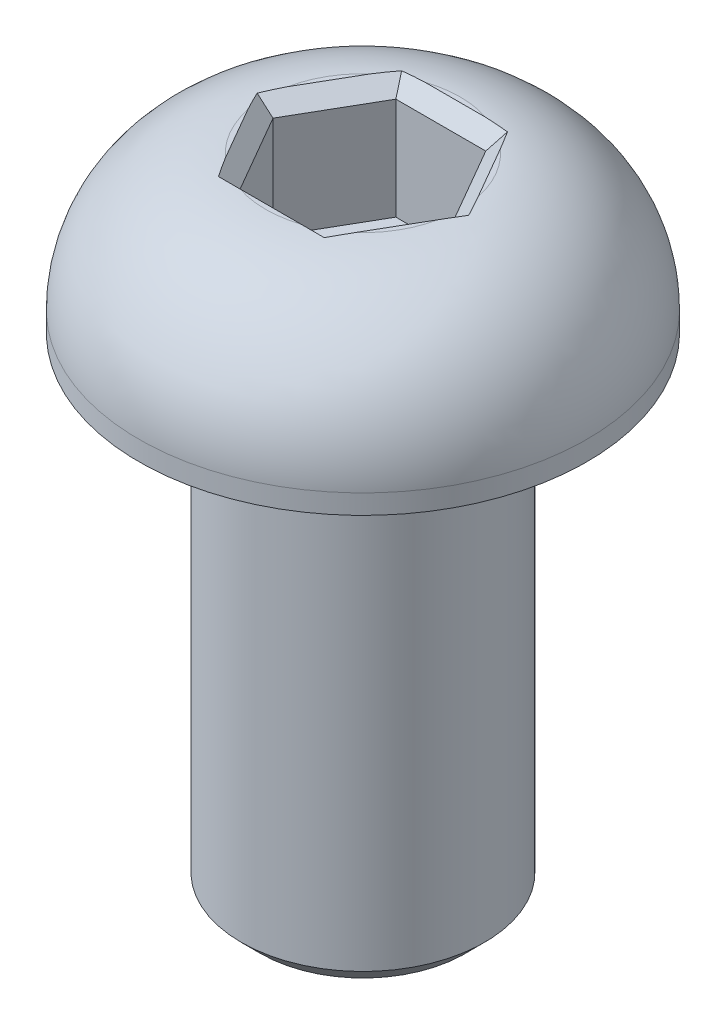
ISO-10303-21;
HEADER;
FILE_DESCRIPTION(('STEP AP214'),'2;1');
FILE_NAME('part.step','',(''),(''),'','','');
FILE_SCHEMA(('AUTOMOTIVE_DESIGN { 1 0 10303 214 1 1 1 1 }'));
ENDSEC;
DATA;
#1=APPLICATION_CONTEXT('core data for automotive mechanical design processes');
#2=APPLICATION_PROTOCOL_DEFINITION('international standard','automotive_design',2000,#1);
#3=PRODUCT_CONTEXT('',#1,'mechanical');
#4=PRODUCT('Part','Part','',(#3));
#5=PRODUCT_RELATED_PRODUCT_CATEGORY('part','',(#4));
#6=PRODUCT_DEFINITION_FORMATION('','',#4);
#7=PRODUCT_DEFINITION_CONTEXT('part definition',#1,'design');
#8=PRODUCT_DEFINITION('design','',#6,#7);
#9=PRODUCT_DEFINITION_SHAPE('','',#8);
#10=(LENGTH_UNIT() NAMED_UNIT(*) SI_UNIT(.MILLI.,.METRE.));
#11=(NAMED_UNIT(*) PLANE_ANGLE_UNIT() SI_UNIT($,.RADIAN.));
#12=(NAMED_UNIT(*) SI_UNIT($,.STERADIAN.) SOLID_ANGLE_UNIT());
#13=UNCERTAINTY_MEASURE_WITH_UNIT(LENGTH_MEASURE(1.E-05),#10,'distance_accuracy_value','');
#14=(GEOMETRIC_REPRESENTATION_CONTEXT(3) GLOBAL_UNCERTAINTY_ASSIGNED_CONTEXT((#13)) GLOBAL_UNIT_ASSIGNED_CONTEXT((#10,
#11,#12)) REPRESENTATION_CONTEXT('',''));
#15=CARTESIAN_POINT('',(0.,0.,0.));
#16=DIRECTION('',(0.,0.,1.));
#17=DIRECTION('',(1.,0.,0.));
#18=AXIS2_PLACEMENT_3D('',#15,#16,#17);
#19=CARTESIAN_POINT('',(0.,16.7549169711781,0.));
#20=DIRECTION('',(0.,-1.,0.));
#21=DIRECTION('',(0.,0.,-1.));
#22=AXIS2_PLACEMENT_3D('',#19,#20,#21);
#23=PLANE('',#22);
#24=CARTESIAN_POINT('',(0.,16.7549169711781,0.));
#25=DIRECTION('',(0.,-1.,0.));
#26=DIRECTION('',(0.,0.,-1.));
#27=AXIS2_PLACEMENT_3D('',#24,#25,#26);
#28=CIRCLE('',#27,2.54000000000019);
#29=CARTESIAN_POINT('',(2.48627667223046,16.7549169711781,0.519642482023581));
#30=VERTEX_POINT('',#29);
#31=CARTESIAN_POINT('',(1.69316192643324,16.7549169711781,1.89335751797642));
#32=VERTEX_POINT('',#31);
#33=EDGE_CURVE('E346',#30,#32,#28,.T.);
#34=ORIENTED_EDGE('',*,*,#33,.F.);
#35=DIRECTION('',(-0.500000000000001,0.,0.86602540378444));
#36=VECTOR('',#35,1.);
#37=CARTESIAN_POINT('',(2.08971929933185,16.7549169711781,1.2065));
#38=LINE('',#37,#36);
#39=EDGE_CURVE('E379',#30,#32,#38,.T.);
#40=ORIENTED_EDGE('',*,*,#39,.T.);
#41=EDGE_LOOP('',(#34,#40));
#42=FACE_BOUND('',#41,.T.);
#43=ADVANCED_FACE('F36',(#42),#23,.F.);
#44=CARTESIAN_POINT('',(0.79311474579721,16.7549169711781,2.413));
#45=VERTEX_POINT('',#44);
#46=CARTESIAN_POINT('',(-0.793114745797206,16.7549169711781,2.413));
#47=VERTEX_POINT('',#46);
#48=EDGE_CURVE('E372',#45,#47,#28,.T.);
#49=ORIENTED_EDGE('',*,*,#48,.F.);
#50=DIRECTION('',(-1.,0.,0.));
#51=VECTOR('',#50,1.);
#52=CARTESIAN_POINT('',(0.,16.7549169711781,2.413));
#53=LINE('',#52,#51);
#54=EDGE_CURVE('E377',#45,#47,#53,.T.);
#55=ORIENTED_EDGE('',*,*,#54,.T.);
#56=EDGE_LOOP('',(#49,#55));
#57=FACE_BOUND('',#56,.T.);
#58=ADVANCED_FACE('F325',(#57),#23,.F.);
#59=CARTESIAN_POINT('',(1.69316192643326,16.7549169711781,-1.89335751797642));
#60=VERTEX_POINT('',#59);
#61=CARTESIAN_POINT('',(2.48627667223046,16.7549169711781,-0.519642482023588));
#62=VERTEX_POINT('',#61);
#63=EDGE_CURVE('E209',#60,#62,#28,.T.);
#64=ORIENTED_EDGE('',*,*,#63,.F.);
#65=DIRECTION('',(0.500000000000001,0.,0.86602540378444));
#66=VECTOR('',#65,1.);
#67=CARTESIAN_POINT('',(2.08971929933186,16.7549169711781,-1.2065));
#68=LINE('',#67,#66);
#69=EDGE_CURVE('E351',#60,#62,#68,.T.);
#70=ORIENTED_EDGE('',*,*,#69,.T.);
#71=EDGE_LOOP('',(#64,#70));
#72=FACE_BOUND('',#71,.T.);
#73=ADVANCED_FACE('F330',(#72),#23,.F.);
#74=CARTESIAN_POINT('',(-1.69316192643324,16.7549169711781,1.89335751797642));
#75=VERTEX_POINT('',#74);
#76=CARTESIAN_POINT('',(-2.48627667223045,16.7549169711781,0.51964248202358));
#77=VERTEX_POINT('',#76);
#78=EDGE_CURVE('E208',#75,#77,#28,.T.);
#79=ORIENTED_EDGE('',*,*,#78,.F.);
#80=DIRECTION('',(-0.500000000000001,0.,-0.86602540378444));
#81=VECTOR('',#80,1.);
#82=CARTESIAN_POINT('',(-2.08971929933185,16.7549169711781,1.2065));
#83=LINE('',#82,#81);
#84=EDGE_CURVE('E380',#75,#77,#83,.T.);
#85=ORIENTED_EDGE('',*,*,#84,.T.);
#86=EDGE_LOOP('',(#79,#85));
#87=FACE_BOUND('',#86,.T.);
#88=ADVANCED_FACE('F339',(#87),#23,.F.);
#89=CARTESIAN_POINT('',(-0.793114745797199,16.7549169711781,-2.413));
#90=VERTEX_POINT('',#89);
#91=CARTESIAN_POINT('',(0.793114745797213,16.7549169711781,-2.413));
#92=VERTEX_POINT('',#91);
#93=EDGE_CURVE('E204',#90,#92,#28,.T.);
#94=ORIENTED_EDGE('',*,*,#93,.F.);
#95=DIRECTION('',(1.,0.,0.));
#96=VECTOR('',#95,1.);
#97=CARTESIAN_POINT('',(0.,16.7549169711781,-2.413));
#98=LINE('',#97,#96);
#99=EDGE_CURVE('E350',#90,#92,#98,.T.);
#100=ORIENTED_EDGE('',*,*,#99,.T.);
#101=EDGE_LOOP('',(#94,#100));
#102=FACE_BOUND('',#101,.T.);
#103=ADVANCED_FACE('F334',(#102),#23,.F.);
#104=CARTESIAN_POINT('',(-2.48627667223045,16.7549169711781,-0.51964248202359));
#105=VERTEX_POINT('',#104);
#106=CARTESIAN_POINT('',(-1.69316192643325,16.7549169711781,-1.89335751797642));
#107=VERTEX_POINT('',#106);
#108=EDGE_CURVE('E207',#105,#107,#28,.T.);
#109=ORIENTED_EDGE('',*,*,#108,.F.);
#110=DIRECTION('',(0.500000000000001,0.,-0.86602540378444));
#111=VECTOR('',#110,1.);
#112=CARTESIAN_POINT('',(-2.08971929933185,16.7549169711781,-1.2065));
#113=LINE('',#112,#111);
#114=EDGE_CURVE('E344',#105,#107,#113,.T.);
#115=ORIENTED_EDGE('',*,*,#114,.T.);
#116=EDGE_LOOP('',(#109,#115));
#117=FACE_BOUND('',#116,.T.);
#118=ADVANCED_FACE('F235',(#117),#23,.F.);
#119=CARTESIAN_POINT('',(0.,13.2080000000609,0.));
#120=DIRECTION('',(0.,-1.,0.));
#121=DIRECTION('',(0.,0.,-1.));
#122=AXIS2_PLACEMENT_3D('',#119,#120,#121);
#123=DEGENERATE_TOROIDAL_SURFACE('',#122,2.28600000000009,3.55599999999999,.T.);
#124=CARTESIAN_POINT('',(0.,13.2080000000609,0.));
#125=DIRECTION('',(0.,-1.,0.));
#126=DIRECTION('',(0.,0.,-1.));
#127=AXIS2_PLACEMENT_3D('',#124,#125,#126);
#128=CIRCLE('',#127,5.84200000000008);
#129=CARTESIAN_POINT('',(0.,13.2080000000609,-5.84200000000008));
#130=VERTEX_POINT('',#129);
#131=EDGE_CURVE('E201',#130,#130,#128,.T.);
#132=ORIENTED_EDGE('',*,*,#131,.F.);
#133=EDGE_LOOP('',(#132));
#134=FACE_BOUND('',#133,.T.);
#135=CARTESIAN_POINT('',(2.48627667223045,16.7549169711781,-0.519642482023587));
#136=CARTESIAN_POINT('',(2.52818544372539,16.7530940779755,-0.443408574106361));
#137=CARTESIAN_POINT('',(2.5696264142895,16.7507437731698,-0.366930097962804));
#138=CARTESIAN_POINT('',(2.65120754004424,16.7445791972126,-0.213298291302693));
#139=CARTESIAN_POINT('',(2.69134708672466,16.7407642516426,-0.136144665919251));
#140=CARTESIAN_POINT('',(2.80868268433474,16.7265746293026,0.0954657953577303));
#141=CARTESIAN_POINT('',(2.88336609079624,16.7134415479983,0.251087412439976));
#142=CARTESIAN_POINT('',(2.98830378672424,16.6862808183736,0.487166292665985));
#143=CARTESIAN_POINT('',(3.02216126306665,16.6759560616065,0.566458675441254));
#144=CARTESIAN_POINT('',(3.08715631173148,16.6525933551633,0.725758814855553));
#145=CARTESIAN_POINT('',(3.11829401845392,16.6395555396634,0.805766535929835));
#146=CARTESIAN_POINT('',(3.17775572696368,16.6104940646894,0.966880186121514));
#147=CARTESIAN_POINT('',(3.2060607160307,16.5944520674145,1.0479898598431));
#148=CARTESIAN_POINT('',(3.25940352641648,16.5593151975962,1.21065605728644));
#149=CARTESIAN_POINT('',(3.28444005349903,16.5402191223274,1.29221274477604));
#150=CARTESIAN_POINT('',(3.30771690583734,16.5195413532933,1.37388497373451));
#151=B_SPLINE_CURVE_WITH_KNOTS('',3,(#135,#136,#137,#138,#139,#140,#141,#142,#143,#144,#145,
#146,#147,#148,#149,#150),.UNSPECIFIED.,.F.,.F.,(4,2,2,2,2,2,2,4),(0.,0.261029158652902,
0.522178657062071,1.04098802332882,1.3014176854424,1.56183447088692,1.82389598533219,
2.08606095740648),.UNSPECIFIED.);
#152=CARTESIAN_POINT('',(2.76012014944036,16.7322511380908,0.));
#153=VERTEX_POINT('',#152);
#154=EDGE_CURVE('E59',#62,#153,#151,.T.);
#155=ORIENTED_EDGE('',*,*,#154,.T.);
#156=CARTESIAN_POINT('',(2.76012014944036,16.7322511380908,0.));
#157=CARTESIAN_POINT('',(2.7382571387866,16.7351930838305,0.0437517367380681));
#158=CARTESIAN_POINT('',(2.71610786170226,16.7378250570692,0.087379356476592));
#159=CARTESIAN_POINT('',(2.67131049977732,16.7425383703163,0.17439728986981));
#160=CARTESIAN_POINT('',(2.64866251194821,16.7446198164084,0.217787647663232));
#161=CARTESIAN_POINT('',(2.60293435257002,16.7483023564426,0.304356223111187));
#162=CARTESIAN_POINT('',(2.57985420727167,16.7499034794612,0.347534453451237));
#163=CARTESIAN_POINT('',(2.53332441503443,16.7526980737379,0.433715606225159));
#164=CARTESIAN_POINT('',(2.50987469769424,16.7538914663193,0.476718493244371));
#165=CARTESIAN_POINT('',(2.48627667223045,16.7549169711781,0.519642482023579));
#166=B_SPLINE_CURVE_WITH_KNOTS('',3,(#156,#157,#158,#159,#160,#161,#162,#163,#164,#165),
.UNSPECIFIED.,.F.,.F.,(4,2,2,2,4),(0.,0.146991335478013,0.293954325803933,0.440908417866134,
0.587890850547138),.UNSPECIFIED.);
#167=EDGE_CURVE('E297',#153,#30,#166,.T.);
#168=ORIENTED_EDGE('',*,*,#167,.T.);
#169=ORIENTED_EDGE('',*,*,#33,.T.);
#170=CARTESIAN_POINT('',(1.69316192643325,16.7549169711781,1.89335751797642));
#171=CARTESIAN_POINT('',(1.66778767445065,16.7538914663194,1.9352560018968));
#172=CARTESIAN_POINT('',(1.64227094052604,16.7526980737379,1.97706549633451));
#173=CARTESIAN_POINT('',(1.59090076901505,16.7499034794612,2.06045205483162));
#174=CARTESIAN_POINT('',(1.5650473972993,16.7483023564426,2.10202916215299));
#175=CARTESIAN_POINT('',(1.51294089148116,16.7446198164085,2.18491519756674));
#176=CARTESIAN_POINT('',(1.48668773326742,16.7425383703165,2.22622410926807));
#177=CARTESIAN_POINT('',(1.43372667332638,16.7378250570691,2.30852872941397));
#178=CARTESIAN_POINT('',(1.40701868486807,16.73519308383,2.34952437591348));
#179=CARTESIAN_POINT('',(1.38006007471942,16.7322511380895,2.39033416691133));
#180=B_SPLINE_CURVE_WITH_KNOTS('',3,(#170,#171,#172,#173,#174,#175,#176,#177,#178,#179),
.UNSPECIFIED.,.F.,.F.,(4,2,2,2,4),(0.,0.146982432680844,0.29393652474287,0.440899515068638,
0.587890850546515),.UNSPECIFIED.);
#181=CARTESIAN_POINT('',(1.38006007471942,16.7322511380895,2.39033416691133));
#182=VERTEX_POINT('',#181);
#183=EDGE_CURVE('E293',#32,#182,#180,.T.);
#184=ORIENTED_EDGE('',*,*,#183,.T.);
#185=CARTESIAN_POINT('',(1.38006007471942,16.7322511380895,2.39033416691133));
#186=CARTESIAN_POINT('',(1.33123845391781,16.73519308383,2.39327611265186));
#187=CARTESIAN_POINT('',(1.28238118837552,16.7378250570691,2.39590808589098));
#188=CARTESIAN_POINT('',(1.18462276650983,16.7425383703165,2.40062139913832));
#189=CARTESIAN_POINT('',(1.13572162046691,16.7446198164085,2.40270284523033));
#190=CARTESIAN_POINT('',(1.03788695527056,16.7483023564426,2.4063853852644));
#191=CARTESIAN_POINT('',(0.988953438256506,16.7499034794612,2.40798650828304));
#192=CARTESIAN_POINT('',(0.891053474508358,16.7526980737379,2.41078110255977));
#193=CARTESIAN_POINT('',(0.842087023243609,16.7538914663194,2.41197449514123));
#194=CARTESIAN_POINT('',(0.79311474579721,16.7549169711781,2.413));
#195=B_SPLINE_CURVE_WITH_KNOTS('',3,(#185,#186,#187,#188,#189,#190,#191,#192,#193,#194),
.UNSPECIFIED.,.F.,.F.,(4,2,2,2,4),(0.,0.146991335477877,0.293954325803644,0.440908417865669,
0.587890850546513),.UNSPECIFIED.);
#196=EDGE_CURVE('E288',#182,#45,#195,.T.);
#197=ORIENTED_EDGE('',*,*,#196,.T.);
#198=ORIENTED_EDGE('',*,*,#48,.T.);
#199=CARTESIAN_POINT('',(-0.793114745797206,16.7549169711781,2.413));
#200=CARTESIAN_POINT('',(-0.842087023243605,16.7538914663194,2.41197449514123));
#201=CARTESIAN_POINT('',(-0.891053474508355,16.7526980737379,2.41078110255977));
#202=CARTESIAN_POINT('',(-0.988953438256504,16.7499034794612,2.40798650828304));
#203=CARTESIAN_POINT('',(-1.03788695527056,16.7483023564426,2.4063853852644));
#204=CARTESIAN_POINT('',(-1.13572162046691,16.7446198164085,2.40270284523033));
#205=CARTESIAN_POINT('',(-1.18462276650983,16.7425383703165,2.40062139913832));
#206=CARTESIAN_POINT('',(-1.28238118837552,16.7378250570691,2.39590808589098));
#207=CARTESIAN_POINT('',(-1.33123845391781,16.73519308383,2.39327611265186));
#208=CARTESIAN_POINT('',(-1.38006007471942,16.7322511380895,2.39033416691133));
#209=B_SPLINE_CURVE_WITH_KNOTS('',3,(#199,#200,#201,#202,#203,#204,#205,#206,#207,#208),
.UNSPECIFIED.,.F.,.F.,(4,2,2,2,4),(0.,0.146982432680844,0.293936524742871,0.440899515068639,
0.587890850546516),.UNSPECIFIED.);
#210=CARTESIAN_POINT('',(-1.38006007471942,16.7322511380895,2.39033416691134));
#211=VERTEX_POINT('',#210);
#212=EDGE_CURVE('E282',#47,#211,#209,.T.);
#213=ORIENTED_EDGE('',*,*,#212,.T.);
#214=CARTESIAN_POINT('',(-1.38006007471942,16.7322511380895,2.39033416691134));
#215=CARTESIAN_POINT('',(-1.40701868486807,16.73519308383,2.34952437591348));
#216=CARTESIAN_POINT('',(-1.43372667332637,16.7378250570691,2.30852872941397));
#217=CARTESIAN_POINT('',(-1.48668773326741,16.7425383703165,2.22622410926807));
#218=CARTESIAN_POINT('',(-1.51294089148115,16.7446198164085,2.18491519756674));
#219=CARTESIAN_POINT('',(-1.56504739729929,16.7483023564426,2.10202916215299));
#220=CARTESIAN_POINT('',(-1.59090076901504,16.7499034794612,2.06045205483162));
#221=CARTESIAN_POINT('',(-1.64227094052604,16.7526980737379,1.97706549633451));
#222=CARTESIAN_POINT('',(-1.66778767445064,16.7538914663194,1.9352560018968));
#223=CARTESIAN_POINT('',(-1.69316192643324,16.7549169711781,1.89335751797642));
#224=B_SPLINE_CURVE_WITH_KNOTS('',3,(#214,#215,#216,#217,#218,#219,#220,#221,#222,#223),
.UNSPECIFIED.,.F.,.F.,(4,2,2,2,4),(0.,0.146991335477877,0.293954325803645,0.440908417865672,
0.587890850546515),.UNSPECIFIED.);
#225=EDGE_CURVE('E276',#211,#75,#224,.T.);
#226=ORIENTED_EDGE('',*,*,#225,.T.);
#227=ORIENTED_EDGE('',*,*,#78,.T.);
#228=CARTESIAN_POINT('',(-2.48627667223045,16.7549169711781,0.519642482023579));
#229=CARTESIAN_POINT('',(-2.50987469769428,16.7538914663194,0.47671849324438));
#230=CARTESIAN_POINT('',(-2.53332441503445,16.7526980737379,0.433715606225154));
#231=CARTESIAN_POINT('',(-2.57985420727166,16.7499034794612,0.34753445345121));
#232=CARTESIAN_POINT('',(-2.60293435256999,16.7483023564425,0.304356223111151));
#233=CARTESIAN_POINT('',(-2.64866251194826,16.7446198164085,0.217787647663217));
#234=CARTESIAN_POINT('',(-2.67131049977746,16.7425383703165,0.174397289869826));
#235=CARTESIAN_POINT('',(-2.71610786170216,16.7378250570691,0.087379356476481));
#236=CARTESIAN_POINT('',(-2.73825713878618,16.73519308383,0.0437517367377995));
#237=CARTESIAN_POINT('',(-2.76012014943915,16.7322511380894,-6.34938168350137E-13));
#238=B_SPLINE_CURVE_WITH_KNOTS('',3,(#228,#229,#230,#231,#232,#233,#234,#235,#236,#237),
.UNSPECIFIED.,.F.,.F.,(4,2,2,2,4),(0.,0.146982432681022,0.293936524743227,0.440899515069173,
0.587890850547228),.UNSPECIFIED.);
#239=CARTESIAN_POINT('',(-2.76012014944036,16.7322511380908,0.));
#240=VERTEX_POINT('',#239);
#241=EDGE_CURVE('E269',#77,#240,#238,.T.);
#242=ORIENTED_EDGE('',*,*,#241,.T.);
#243=CARTESIAN_POINT('',(-3.31161514656212,16.5160512049456,1.38761722142536));
#244=CARTESIAN_POINT('',(-3.28836962139856,16.5370538380933,1.3053495244981));
#245=CARTESIAN_POINT('',(-3.26333342665327,16.5564503470188,1.22319254532008));
#246=CARTESIAN_POINT('',(-3.20993301229199,16.5921391589915,1.05932269055566));
#247=CARTESIAN_POINT('',(-3.18157012946489,16.6084327020689,0.977609650295168));
#248=CARTESIAN_POINT('',(-3.12194209360952,16.6379455050499,0.815305256676072));
#249=CARTESIAN_POINT('',(-3.09069667962286,16.6511837754121,0.734710071423246));
#250=CARTESIAN_POINT('',(-3.02543755717613,16.6749019880353,0.574241530441902));
#251=CARTESIAN_POINT('',(-2.99142371176856,16.685381793733,0.494368210639707));
#252=CARTESIAN_POINT('',(-2.8859585538727,16.7129409381653,0.256578909871189));
#253=CARTESIAN_POINT('',(-2.81083994192082,16.7262547492917,0.0998420351236731));
#254=CARTESIAN_POINT('',(-2.69275796447915,16.7406226478771,-0.13341774643421));
#255=CARTESIAN_POINT('',(-2.65235012840098,16.7444816037208,-0.211124083232894));
#256=CARTESIAN_POINT('',(-2.57021147410833,16.7507105325722,-0.365850263436021));
#257=CARTESIAN_POINT('',(-2.52848128826795,16.7530812063463,-0.442870413068994));
#258=CARTESIAN_POINT('',(-2.48627667223045,16.7549169711781,-0.519642482023587));
#259=B_SPLINE_CURVE_WITH_KNOTS('',3,(#243,#244,#245,#246,#247,#248,#249,#250,#251,#252,#253,
#254,#255,#256,#257,#258),.UNSPECIFIED.,.F.,.F.,(4,2,2,2,2,2,2,4),(0.,0.264039690808835,
0.527973641678167,0.790218191476547,1.05247572176364,1.57488283323438,1.8378784886053,
2.10075021787703),.UNSPECIFIED.);
#260=EDGE_CURVE('E245',#240,#105,#259,.T.);
#261=ORIENTED_EDGE('',*,*,#260,.T.);
#262=ORIENTED_EDGE('',*,*,#108,.T.);
#263=CARTESIAN_POINT('',(-1.69316192643325,16.7549169711781,-1.89335751797642));
#264=CARTESIAN_POINT('',(-1.66778767445066,16.7538914663194,-1.93525600189679));
#265=CARTESIAN_POINT('',(-1.64227094052605,16.7526980737379,-1.97706549633451));
#266=CARTESIAN_POINT('',(-1.59090076901506,16.7499034794612,-2.06045205483162));
#267=CARTESIAN_POINT('',(-1.56504739729931,16.7483023564426,-2.10202916215299));
#268=CARTESIAN_POINT('',(-1.51294089148116,16.7446198164085,-2.18491519756674));
#269=CARTESIAN_POINT('',(-1.48668773326742,16.7425383703165,-2.22622410926808));
#270=CARTESIAN_POINT('',(-1.43372667332638,16.7378250570691,-2.30852872941398));
#271=CARTESIAN_POINT('',(-1.40701868486807,16.73519308383,-2.34952437591348));
#272=CARTESIAN_POINT('',(-1.38006007471942,16.7322511380895,-2.39033416691134));
#273=B_SPLINE_CURVE_WITH_KNOTS('',3,(#263,#264,#265,#266,#267,#268,#269,#270,#271,#272),
.UNSPECIFIED.,.F.,.F.,(4,2,2,2,4),(0.,0.146982432680846,0.293936524742876,0.440899515068647,
0.587890850546527),.UNSPECIFIED.);
#274=CARTESIAN_POINT('',(-1.38006007471942,16.7322511380895,-2.39033416691134));
#275=VERTEX_POINT('',#274);
#276=EDGE_CURVE('E213',#107,#275,#273,.T.);
#277=ORIENTED_EDGE('',*,*,#276,.T.);
#278=CARTESIAN_POINT('',(-1.38006007471942,16.7322511380895,-2.39033416691134));
#279=CARTESIAN_POINT('',(-1.33123845391781,16.73519308383,-2.39327611265187));
#280=CARTESIAN_POINT('',(-1.28238118837552,16.7378250570691,-2.39590808589099));
#281=CARTESIAN_POINT('',(-1.18462276650983,16.7425383703165,-2.40062139913834));
#282=CARTESIAN_POINT('',(-1.13572162046691,16.7446198164085,-2.40270284523034));
#283=CARTESIAN_POINT('',(-1.03788695527055,16.7483023564426,-2.40638538526442));
#284=CARTESIAN_POINT('',(-0.9889534382565,16.7499034794612,-2.40798650828306));
#285=CARTESIAN_POINT('',(-0.89105347450835,16.7526980737379,-2.41078110255979));
#286=CARTESIAN_POINT('',(-0.8420870232436,16.7538914663194,-2.41197449514124));
#287=CARTESIAN_POINT('',(-0.793114745797199,16.7549169711781,-2.413));
#288=B_SPLINE_CURVE_WITH_KNOTS('',3,(#278,#279,#280,#281,#282,#283,#284,#285,#286,#287),
.UNSPECIFIED.,.F.,.F.,(4,2,2,2,4),(0.,0.146991335477879,0.293954325803649,0.440908417865677,
0.587890850546523),.UNSPECIFIED.);
#289=EDGE_CURVE('E220',#275,#90,#288,.T.);
#290=ORIENTED_EDGE('',*,*,#289,.T.);
#291=ORIENTED_EDGE('',*,*,#93,.T.);
#292=CARTESIAN_POINT('',(0.79311474579721,16.7549169711781,-2.413));
#293=CARTESIAN_POINT('',(0.84208702324361,16.7538914663194,-2.41197449514124));
#294=CARTESIAN_POINT('',(0.89105347450836,16.7526980737379,-2.41078110255979));
#295=CARTESIAN_POINT('',(0.98895343825651,16.7499034794612,-2.40798650828306));
#296=CARTESIAN_POINT('',(1.03788695527056,16.7483023564426,-2.40638538526442));
#297=CARTESIAN_POINT('',(1.13572162046692,16.7446198164085,-2.40270284523034));
#298=CARTESIAN_POINT('',(1.18462276650984,16.7425383703165,-2.40062139913834));
#299=CARTESIAN_POINT('',(1.28238118837553,16.7378250570691,-2.395908085891));
#300=CARTESIAN_POINT('',(1.33123845391782,16.73519308383,-2.39327611265187));
#301=CARTESIAN_POINT('',(1.38006007471943,16.7322511380895,-2.39033416691134));
#302=B_SPLINE_CURVE_WITH_KNOTS('',3,(#292,#293,#294,#295,#296,#297,#298,#299,#300,#301),
.UNSPECIFIED.,.F.,.F.,(4,2,2,2,4),(0.,0.146982432680846,0.293936524742874,0.440899515068644,
0.587890850546523),.UNSPECIFIED.);
#303=CARTESIAN_POINT('',(1.38006007471943,16.7322511380895,-2.39033416691134));
#304=VERTEX_POINT('',#303);
#305=EDGE_CURVE('E251',#92,#304,#302,.T.);
#306=ORIENTED_EDGE('',*,*,#305,.T.);
#307=CARTESIAN_POINT('',(1.38006007471943,16.7322511380895,-2.39033416691134));
#308=CARTESIAN_POINT('',(1.40701868486808,16.73519308383,-2.34952437591348));
#309=CARTESIAN_POINT('',(1.43372667332639,16.7378250570691,-2.30852872941398));
#310=CARTESIAN_POINT('',(1.48668773326743,16.7425383703165,-2.22622410926808));
#311=CARTESIAN_POINT('',(1.51294089148117,16.7446198164085,-2.18491519756674));
#312=CARTESIAN_POINT('',(1.56504739729931,16.7483023564426,-2.10202916215299));
#313=CARTESIAN_POINT('',(1.59090076901506,16.7499034794612,-2.06045205483162));
#314=CARTESIAN_POINT('',(1.64227094052606,16.7526980737379,-1.97706549633451));
#315=CARTESIAN_POINT('',(1.66778767445066,16.7538914663194,-1.93525600189679));
#316=CARTESIAN_POINT('',(1.69316192643326,16.7549169711781,-1.89335751797641));
#317=B_SPLINE_CURVE_WITH_KNOTS('',3,(#307,#308,#309,#310,#311,#312,#313,#314,#315,#316),
.UNSPECIFIED.,.F.,.F.,(4,2,2,2,4),(0.,0.146991335477881,0.293954325803651,0.440908417865681,
0.587890850546528),.UNSPECIFIED.);
#318=EDGE_CURVE('E257',#304,#60,#317,.T.);
#319=ORIENTED_EDGE('',*,*,#318,.T.);
#320=ORIENTED_EDGE('',*,*,#63,.T.);
#321=EDGE_LOOP('',(#155,#168,#169,#184,#197,#198,#213,#226,#227,#242,#261,#262,#277,#290,#291,
#306,#319,#320));
#322=FACE_BOUND('',#321,.T.);
#323=ADVANCED_FACE('F229',(#134,#322),#123,.T.);
#324=CARTESIAN_POINT('',(0.,0.,0.));
#325=DIRECTION('',(0.,-1.,0.));
#326=DIRECTION('',(0.,0.,-1.));
#327=AXIS2_PLACEMENT_3D('',#324,#325,#326);
#328=CYLINDRICAL_SURFACE('',#327,5.84200000000007);
#329=CARTESIAN_POINT('',(0.,12.7000000000609,0.));
#330=DIRECTION('',(0.,-1.,0.));
#331=DIRECTION('',(0.,0.,-1.));
#332=AXIS2_PLACEMENT_3D('',#329,#330,#331);
#333=CIRCLE('',#332,5.84200000000007);
#334=CARTESIAN_POINT('',(0.,12.7000000000609,-5.84200000000008));
#335=VERTEX_POINT('',#334);
#336=EDGE_CURVE('E198',#335,#335,#333,.T.);
#337=ORIENTED_EDGE('',*,*,#336,.F.);
#338=EDGE_LOOP('',(#337));
#339=FACE_BOUND('',#338,.T.);
#340=ORIENTED_EDGE('',*,*,#131,.T.);
#341=EDGE_LOOP('',(#340));
#342=FACE_BOUND('',#341,.T.);
#343=ADVANCED_FACE('F234',(#339,#342),#328,.T.);
#344=CARTESIAN_POINT('',(-5.84200000000007,12.7000000000609,0.));
#345=DIRECTION('',(0.,1.,0.));
#346=DIRECTION('',(0.,0.,1.));
#347=AXIS2_PLACEMENT_3D('',#344,#345,#346);
#348=PLANE('',#347);
#349=CARTESIAN_POINT('',(0.,12.7000000000609,0.));
#350=DIRECTION('',(0.,-1.,0.));
#351=DIRECTION('',(0.,0.,-1.));
#352=AXIS2_PLACEMENT_3D('',#349,#350,#351);
#353=CIRCLE('',#352,3.17500000000008);
#354=CARTESIAN_POINT('',(0.,12.7000000000609,-3.17500000000009));
#355=VERTEX_POINT('',#354);
#356=EDGE_CURVE('E186',#355,#355,#353,.T.);
#357=ORIENTED_EDGE('',*,*,#356,.F.);
#358=EDGE_LOOP('',(#357));
#359=FACE_BOUND('',#358,.T.);
#360=ORIENTED_EDGE('',*,*,#336,.T.);
#361=EDGE_LOOP('',(#360));
#362=FACE_BOUND('',#361,.T.);
#363=ADVANCED_FACE('F406',(#359,#362),#348,.F.);
#364=CARTESIAN_POINT('',(0.,0.,0.));
#365=DIRECTION('',(0.,-1.,0.));
#366=DIRECTION('',(0.,0.,-1.));
#367=AXIS2_PLACEMENT_3D('',#364,#365,#366);
#368=CYLINDRICAL_SURFACE('',#367,3.17500000000008);
#369=CARTESIAN_POINT('',(0.,0.508000000000008,0.));
#370=DIRECTION('',(0.,1.,0.));
#371=DIRECTION('',(0.,0.,1.));
#372=AXIS2_PLACEMENT_3D('',#369,#370,#371);
#373=CIRCLE('',#372,3.17500000000008);
#374=CARTESIAN_POINT('',(0.,0.508000000000008,3.17500000000009));
#375=VERTEX_POINT('',#374);
#376=EDGE_CURVE('E11',#375,#375,#373,.T.);
#377=ORIENTED_EDGE('',*,*,#376,.T.);
#378=EDGE_LOOP('',(#377));
#379=FACE_BOUND('',#378,.T.);
#380=ORIENTED_EDGE('',*,*,#356,.T.);
#381=EDGE_LOOP('',(#380));
#382=FACE_BOUND('',#381,.T.);
#383=ADVANCED_FACE('F403',(#379,#382),#368,.T.);
#384=CARTESIAN_POINT('',(-3.17500000000008,0.,0.));
#385=DIRECTION('',(0.,1.,0.));
#386=DIRECTION('',(0.,0.,1.));
#387=AXIS2_PLACEMENT_3D('',#384,#385,#386);
#388=PLANE('',#387);
#389=CARTESIAN_POINT('',(0.,0.,0.));
#390=DIRECTION('',(0.,1.,0.));
#391=DIRECTION('',(0.,0.,1.));
#392=AXIS2_PLACEMENT_3D('',#389,#390,#391);
#393=CIRCLE('',#392,2.66700000000008);
#394=CARTESIAN_POINT('',(0.,0.,2.66700000000009));
#395=VERTEX_POINT('',#394);
#396=EDGE_CURVE('E44',#395,#395,#393,.F.);
#397=ORIENTED_EDGE('',*,*,#396,.T.);
#398=EDGE_LOOP('',(#397));
#399=FACE_BOUND('',#398,.T.);
#400=ADVANCED_FACE('F395',(#399),#388,.F.);
#401=CARTESIAN_POINT('',(-1.17317574699332,13.7072169711781,2.032));
#402=DIRECTION('',(0.,0.,1.));
#403=DIRECTION('',(1.,0.,0.));
#404=AXIS2_PLACEMENT_3D('',#401,#402,#403);
#405=PLANE('',#404);
#406=DIRECTION('',(0.,1.,0.));
#407=VECTOR('',#406,1.);
#408=CARTESIAN_POINT('',(-1.17317574699332,13.7072169711781,2.032));
#409=LINE('',#408,#407);
#410=CARTESIAN_POINT('',(-1.17317574699332,13.7072169711781,2.032));
#411=VERTEX_POINT('',#410);
#412=CARTESIAN_POINT('',(-1.17317574699332,16.3739169711782,2.032));
#413=VERTEX_POINT('',#412);
#414=EDGE_CURVE('E184',#411,#413,#409,.T.);
#415=ORIENTED_EDGE('',*,*,#414,.T.);
#416=DIRECTION('',(1.,0.,0.));
#417=VECTOR('',#416,1.);
#418=CARTESIAN_POINT('',(-1.17317574699332,16.3739169711782,2.032));
#419=LINE('',#418,#417);
#420=CARTESIAN_POINT('',(1.17317574699332,16.3739169711782,2.032));
#421=VERTEX_POINT('',#420);
#422=EDGE_CURVE('E152',#413,#421,#419,.T.);
#423=ORIENTED_EDGE('',*,*,#422,.T.);
#424=DIRECTION('',(0.,1.,0.));
#425=VECTOR('',#424,1.);
#426=CARTESIAN_POINT('',(1.17317574699332,13.7072169711781,2.032));
#427=LINE('',#426,#425);
#428=CARTESIAN_POINT('',(1.17317574699332,13.7072169711781,2.032));
#429=VERTEX_POINT('',#428);
#430=EDGE_CURVE('E145',#429,#421,#427,.T.);
#431=ORIENTED_EDGE('',*,*,#430,.F.);
#432=DIRECTION('',(1.,0.,0.));
#433=VECTOR('',#432,1.);
#434=CARTESIAN_POINT('',(-1.17317574699332,13.7072169711781,2.032));
#435=LINE('',#434,#433);
#436=EDGE_CURVE('E149',#411,#429,#435,.T.);
#437=ORIENTED_EDGE('',*,*,#436,.F.);
#438=EDGE_LOOP('',(#415,#423,#431,#437));
#439=FACE_BOUND('',#438,.T.);
#440=ADVANCED_FACE('F147',(#439),#405,.F.);
#441=CARTESIAN_POINT('',(-2.34635149398664,13.7072169711781,0.));
#442=DIRECTION('',(-0.86602540378444,0.,0.500000000000001));
#443=DIRECTION('',(0.500000000000001,0.,0.86602540378444));
#444=AXIS2_PLACEMENT_3D('',#441,#442,#443);
#445=PLANE('',#444);
#446=DIRECTION('',(0.,1.,0.));
#447=VECTOR('',#446,1.);
#448=CARTESIAN_POINT('',(-2.34635149398664,13.7072169711781,0.));
#449=LINE('',#448,#447);
#450=CARTESIAN_POINT('',(-2.34635149398664,13.7072169711781,0.));
#451=VERTEX_POINT('',#450);
#452=CARTESIAN_POINT('',(-2.34635149398664,16.3739169711781,0.));
#453=VERTEX_POINT('',#452);
#454=EDGE_CURVE('E187',#451,#453,#449,.T.);
#455=ORIENTED_EDGE('',*,*,#454,.T.);
#456=DIRECTION('',(0.500000000000001,0.,0.86602540378444));
#457=VECTOR('',#456,1.);
#458=CARTESIAN_POINT('',(-2.34635149398664,16.3739169711782,0.));
#459=LINE('',#458,#457);
#460=EDGE_CURVE('E51',#453,#413,#459,.T.);
#461=ORIENTED_EDGE('',*,*,#460,.T.);
#462=ORIENTED_EDGE('',*,*,#414,.F.);
#463=DIRECTION('',(0.500000000000001,0.,0.86602540378444));
#464=VECTOR('',#463,1.);
#465=CARTESIAN_POINT('',(-2.34635149398664,13.7072169711781,0.));
#466=LINE('',#465,#464);
#467=EDGE_CURVE('E157',#451,#411,#466,.T.);
#468=ORIENTED_EDGE('',*,*,#467,.F.);
#469=EDGE_LOOP('',(#455,#461,#462,#468));
#470=FACE_BOUND('',#469,.T.);
#471=ADVANCED_FACE('F441',(#470),#445,.F.);
#472=CARTESIAN_POINT('',(-1.17317574699331,13.7072169711781,-2.032));
#473=DIRECTION('',(-0.86602540378444,0.,-0.500000000000001));
#474=DIRECTION('',(-0.500000000000001,0.,0.86602540378444));
#475=AXIS2_PLACEMENT_3D('',#472,#473,#474);
#476=PLANE('',#475);
#477=DIRECTION('',(0.,1.,0.));
#478=VECTOR('',#477,1.);
#479=CARTESIAN_POINT('',(-1.17317574699331,13.7072169711781,-2.032));
#480=LINE('',#479,#478);
#481=CARTESIAN_POINT('',(-1.17317574699331,13.7072169711781,-2.032));
#482=VERTEX_POINT('',#481);
#483=CARTESIAN_POINT('',(-1.17317574699332,16.3739169711781,-2.032));
#484=VERTEX_POINT('',#483);
#485=EDGE_CURVE('E189',#482,#484,#480,.T.);
#486=ORIENTED_EDGE('',*,*,#485,.T.);
#487=DIRECTION('',(-0.500000000000001,0.,0.86602540378444));
#488=VECTOR('',#487,1.);
#489=CARTESIAN_POINT('',(-1.17317574699332,16.3739169711781,-2.032));
#490=LINE('',#489,#488);
#491=EDGE_CURVE('E357',#484,#453,#490,.T.);
#492=ORIENTED_EDGE('',*,*,#491,.T.);
#493=ORIENTED_EDGE('',*,*,#454,.F.);
#494=DIRECTION('',(-0.500000000000001,0.,0.86602540378444));
#495=VECTOR('',#494,1.);
#496=CARTESIAN_POINT('',(-1.17317574699331,13.7072169711781,-2.032));
#497=LINE('',#496,#495);
#498=EDGE_CURVE('E181',#482,#451,#497,.T.);
#499=ORIENTED_EDGE('',*,*,#498,.F.);
#500=EDGE_LOOP('',(#486,#492,#493,#499));
#501=FACE_BOUND('',#500,.T.);
#502=ADVANCED_FACE('F448',(#501),#476,.F.);
#503=CARTESIAN_POINT('',(1.17317574699333,13.7072169711781,-2.03200000000001));
#504=DIRECTION('',(0.,0.,-1.));
#505=DIRECTION('',(-1.,0.,0.));
#506=AXIS2_PLACEMENT_3D('',#503,#504,#505);
#507=PLANE('',#506);
#508=DIRECTION('',(0.,1.,0.));
#509=VECTOR('',#508,1.);
#510=CARTESIAN_POINT('',(1.17317574699333,13.7072169711781,-2.03200000000001));
#511=LINE('',#510,#509);
#512=CARTESIAN_POINT('',(1.17317574699333,13.7072169711781,-2.03200000000001));
#513=VERTEX_POINT('',#512);
#514=CARTESIAN_POINT('',(1.17317574699333,16.3739169711781,-2.03200000000001));
#515=VERTEX_POINT('',#514);
#516=EDGE_CURVE('E192',#513,#515,#511,.T.);
#517=ORIENTED_EDGE('',*,*,#516,.T.);
#518=DIRECTION('',(-1.,0.,0.));
#519=VECTOR('',#518,1.);
#520=CARTESIAN_POINT('',(1.17317574699333,16.3739169711781,-2.03200000000001));
#521=LINE('',#520,#519);
#522=EDGE_CURVE('E355',#515,#484,#521,.T.);
#523=ORIENTED_EDGE('',*,*,#522,.T.);
#524=ORIENTED_EDGE('',*,*,#485,.F.);
#525=DIRECTION('',(-1.,0.,0.));
#526=VECTOR('',#525,1.);
#527=CARTESIAN_POINT('',(1.17317574699333,13.7072169711781,-2.03200000000001));
#528=LINE('',#527,#526);
#529=EDGE_CURVE('E178',#513,#482,#528,.T.);
#530=ORIENTED_EDGE('',*,*,#529,.F.);
#531=EDGE_LOOP('',(#517,#523,#524,#530));
#532=FACE_BOUND('',#531,.T.);
#533=ADVANCED_FACE('F455',(#532),#507,.F.);
#534=CARTESIAN_POINT('',(2.34635149398665,13.7072169711781,0.));
#535=DIRECTION('',(0.86602540378444,0.,-0.500000000000001));
#536=DIRECTION('',(-0.500000000000001,0.,-0.86602540378444));
#537=AXIS2_PLACEMENT_3D('',#534,#535,#536);
#538=PLANE('',#537);
#539=DIRECTION('',(0.,1.,0.));
#540=VECTOR('',#539,1.);
#541=CARTESIAN_POINT('',(2.34635149398665,13.7072169711781,0.));
#542=LINE('',#541,#540);
#543=CARTESIAN_POINT('',(2.34635149398665,13.7072169711781,0.));
#544=VERTEX_POINT('',#543);
#545=CARTESIAN_POINT('',(2.34635149398664,16.3739169711781,0.));
#546=VERTEX_POINT('',#545);
#547=EDGE_CURVE('E156',#544,#546,#542,.T.);
#548=ORIENTED_EDGE('',*,*,#547,.T.);
#549=DIRECTION('',(-0.500000000000001,0.,-0.86602540378444));
#550=VECTOR('',#549,1.);
#551=CARTESIAN_POINT('',(2.34635149398664,16.3739169711781,0.));
#552=LINE('',#551,#550);
#553=EDGE_CURVE('E210',#546,#515,#552,.T.);
#554=ORIENTED_EDGE('',*,*,#553,.T.);
#555=ORIENTED_EDGE('',*,*,#516,.F.);
#556=DIRECTION('',(-0.500000000000001,0.,-0.86602540378444));
#557=VECTOR('',#556,1.);
#558=CARTESIAN_POINT('',(2.34635149398665,13.7072169711781,0.));
#559=LINE('',#558,#557);
#560=EDGE_CURVE('E166',#544,#513,#559,.T.);
#561=ORIENTED_EDGE('',*,*,#560,.F.);
#562=EDGE_LOOP('',(#548,#554,#555,#561));
#563=FACE_BOUND('',#562,.T.);
#564=ADVANCED_FACE('F463',(#563),#538,.F.);
#565=CARTESIAN_POINT('',(1.17317574699332,13.7072169711781,2.032));
#566=DIRECTION('',(0.86602540378444,0.,0.500000000000001));
#567=DIRECTION('',(0.500000000000001,0.,-0.86602540378444));
#568=AXIS2_PLACEMENT_3D('',#565,#566,#567);
#569=PLANE('',#568);
#570=ORIENTED_EDGE('',*,*,#430,.T.);
#571=DIRECTION('',(0.500000000000001,0.,-0.86602540378444));
#572=VECTOR('',#571,1.);
#573=CARTESIAN_POINT('',(1.17317574699332,16.3739169711782,2.032));
#574=LINE('',#573,#572);
#575=EDGE_CURVE('E360',#421,#546,#574,.T.);
#576=ORIENTED_EDGE('',*,*,#575,.T.);
#577=ORIENTED_EDGE('',*,*,#547,.F.);
#578=DIRECTION('',(0.500000000000001,0.,-0.86602540378444));
#579=VECTOR('',#578,1.);
#580=CARTESIAN_POINT('',(1.17317574699332,13.7072169711781,2.032));
#581=LINE('',#580,#579);
#582=EDGE_CURVE('E160',#429,#544,#581,.T.);
#583=ORIENTED_EDGE('',*,*,#582,.F.);
#584=EDGE_LOOP('',(#570,#576,#577,#583));
#585=FACE_BOUND('',#584,.T.);
#586=ADVANCED_FACE('F161',(#585),#569,.F.);
#587=CARTESIAN_POINT('',(1.17317574699332,13.7072169711781,2.032));
#588=DIRECTION('',(0.,1.,0.));
#589=DIRECTION('',(0.,0.,1.));
#590=AXIS2_PLACEMENT_3D('',#587,#588,#589);
#591=PLANE('',#590);
#592=ORIENTED_EDGE('',*,*,#436,.T.);
#593=ORIENTED_EDGE('',*,*,#582,.T.);
#594=ORIENTED_EDGE('',*,*,#560,.T.);
#595=ORIENTED_EDGE('',*,*,#529,.T.);
#596=ORIENTED_EDGE('',*,*,#498,.T.);
#597=ORIENTED_EDGE('',*,*,#467,.T.);
#598=EDGE_LOOP('',(#592,#593,#594,#595,#596,#597));
#599=FACE_BOUND('',#598,.T.);
#600=ADVANCED_FACE('F168',(#599),#591,.T.);
#601=CARTESIAN_POINT('',(-1.17317574699332,16.3739169711781,-2.032));
#602=DIRECTION('',(-0.612372435695797,-0.707106781186545,-0.353553390593275));
#603=DIRECTION('',(0.755928946018454,-0.654653670707979,0.));
#604=AXIS2_PLACEMENT_3D('',#601,#602,#603);
#605=PLANE('',#604);
#606=ORIENTED_EDGE('',*,*,#260,.F.);
#607=DIRECTION('',(0.755928946018454,-0.654653670707979,0.));
#608=VECTOR('',#607,1.);
#609=CARTESIAN_POINT('',(-2.34635149398664,16.3739169711782,0.));
#610=LINE('',#609,#608);
#611=EDGE_CURVE('E388',#240,#453,#610,.T.);
#612=ORIENTED_EDGE('',*,*,#611,.T.);
#613=ORIENTED_EDGE('',*,*,#491,.F.);
#614=DIRECTION('',(0.377964473009227,-0.65465367070798,0.654653670707976));
#615=VECTOR('',#614,1.);
#616=CARTESIAN_POINT('',(-1.17317574699332,16.3739169711781,-2.032));
#617=LINE('',#616,#615);
#618=EDGE_CURVE('E171',#275,#484,#617,.T.);
#619=ORIENTED_EDGE('',*,*,#618,.F.);
#620=ORIENTED_EDGE('',*,*,#276,.F.);
#621=ORIENTED_EDGE('',*,*,#114,.F.);
#622=EDGE_LOOP('',(#606,#612,#613,#619,#620,#621));
#623=FACE_BOUND('',#622,.T.);
#624=ADVANCED_FACE('F226',(#623),#605,.F.);
#625=CARTESIAN_POINT('',(1.17317574699333,16.3739169711781,-2.03200000000001));
#626=DIRECTION('',(0.,-0.707106781186545,-0.70710678118655));
#627=DIRECTION('',(0.,0.70710678118655,-0.707106781186546));
#628=AXIS2_PLACEMENT_3D('',#625,#626,#627);
#629=PLANE('',#628);
#630=ORIENTED_EDGE('',*,*,#618,.T.);
#631=ORIENTED_EDGE('',*,*,#522,.F.);
#632=DIRECTION('',(-0.377964473009227,-0.654653670707979,0.654653670707976));
#633=VECTOR('',#632,1.);
#634=CARTESIAN_POINT('',(1.17317574699333,16.3739169711781,-2.03200000000001));
#635=LINE('',#634,#633);
#636=EDGE_CURVE('E174',#304,#515,#635,.T.);
#637=ORIENTED_EDGE('',*,*,#636,.F.);
#638=ORIENTED_EDGE('',*,*,#305,.F.);
#639=ORIENTED_EDGE('',*,*,#99,.F.);
#640=ORIENTED_EDGE('',*,*,#289,.F.);
#641=EDGE_LOOP('',(#630,#631,#637,#638,#639,#640));
#642=FACE_BOUND('',#641,.T.);
#643=ADVANCED_FACE('F321',(#642),#629,.F.);
#644=CARTESIAN_POINT('',(2.34635149398664,16.3739169711781,0.));
#645=DIRECTION('',(0.612372435695797,-0.707106781186546,-0.353553390593275));
#646=DIRECTION('',(0.755928946018454,0.654653670707979,0.));
#647=AXIS2_PLACEMENT_3D('',#644,#645,#646);
#648=PLANE('',#647);
#649=ORIENTED_EDGE('',*,*,#154,.F.);
#650=ORIENTED_EDGE('',*,*,#69,.F.);
#651=ORIENTED_EDGE('',*,*,#318,.F.);
#652=ORIENTED_EDGE('',*,*,#636,.T.);
#653=ORIENTED_EDGE('',*,*,#553,.F.);
#654=DIRECTION('',(0.755928946018455,0.654653670707979,0.));
#655=VECTOR('',#654,1.);
#656=CARTESIAN_POINT('',(1.67596535284761,15.7933455426067,0.));
#657=LINE('',#656,#655);
#658=EDGE_CURVE('E386',#546,#153,#657,.T.);
#659=ORIENTED_EDGE('',*,*,#658,.T.);
#660=EDGE_LOOP('',(#649,#650,#651,#652,#653,#659));
#661=FACE_BOUND('',#660,.T.);
#662=ADVANCED_FACE('F315',(#661),#648,.F.);
#663=CARTESIAN_POINT('',(-2.34635149398664,16.3739169711782,0.));
#664=DIRECTION('',(-0.612372435695796,-0.707106781186547,0.353553390593275));
#665=DIRECTION('',(0.755928946018455,-0.654653670707978,0.));
#666=AXIS2_PLACEMENT_3D('',#663,#664,#665);
#667=PLANE('',#666);
#668=ORIENTED_EDGE('',*,*,#84,.F.);
#669=ORIENTED_EDGE('',*,*,#225,.F.);
#670=DIRECTION('',(-0.377964473009227,0.654653670707978,0.654653670707977));
#671=VECTOR('',#670,1.);
#672=CARTESIAN_POINT('',(-0.8379826764238,15.7933455426067,1.45142857142857));
#673=LINE('',#672,#671);
#674=EDGE_CURVE('E361',#413,#211,#673,.T.);
#675=ORIENTED_EDGE('',*,*,#674,.F.);
#676=ORIENTED_EDGE('',*,*,#460,.F.);
#677=ORIENTED_EDGE('',*,*,#611,.F.);
#678=ORIENTED_EDGE('',*,*,#241,.F.);
#679=EDGE_LOOP('',(#668,#669,#675,#676,#677,#678));
#680=FACE_BOUND('',#679,.T.);
#681=ADVANCED_FACE('F310',(#680),#667,.F.);
#682=CARTESIAN_POINT('',(-1.17317574699332,16.3739169711782,2.032));
#683=DIRECTION('',(0.,-0.707106781186547,0.707106781186549));
#684=DIRECTION('',(0.,-0.707106781186548,-0.707106781186547));
#685=AXIS2_PLACEMENT_3D('',#682,#683,#684);
#686=PLANE('',#685);
#687=ORIENTED_EDGE('',*,*,#54,.F.);
#688=ORIENTED_EDGE('',*,*,#196,.F.);
#689=DIRECTION('',(0.377964473009227,0.654653670707978,0.654653670707977));
#690=VECTOR('',#689,1.);
#691=CARTESIAN_POINT('',(0.837982676423803,15.7933455426067,1.45142857142858));
#692=LINE('',#691,#690);
#693=EDGE_CURVE('E390',#421,#182,#692,.T.);
#694=ORIENTED_EDGE('',*,*,#693,.F.);
#695=ORIENTED_EDGE('',*,*,#422,.F.);
#696=ORIENTED_EDGE('',*,*,#674,.T.);
#697=ORIENTED_EDGE('',*,*,#212,.F.);
#698=EDGE_LOOP('',(#687,#688,#694,#695,#696,#697));
#699=FACE_BOUND('',#698,.T.);
#700=ADVANCED_FACE('F305',(#699),#686,.F.);
#701=CARTESIAN_POINT('',(1.17317574699332,16.3739169711782,2.032));
#702=DIRECTION('',(0.612372435695796,-0.707106781186547,0.353553390593275));
#703=DIRECTION('',(0.755928946018455,0.654653670707978,0.));
#704=AXIS2_PLACEMENT_3D('',#701,#702,#703);
#705=PLANE('',#704);
#706=ORIENTED_EDGE('',*,*,#183,.F.);
#707=ORIENTED_EDGE('',*,*,#39,.F.);
#708=ORIENTED_EDGE('',*,*,#167,.F.);
#709=ORIENTED_EDGE('',*,*,#658,.F.);
#710=ORIENTED_EDGE('',*,*,#575,.F.);
#711=ORIENTED_EDGE('',*,*,#693,.T.);
#712=EDGE_LOOP('',(#706,#707,#708,#709,#710,#711));
#713=FACE_BOUND('',#712,.T.);
#714=ADVANCED_FACE('F302',(#713),#705,.F.);
#715=CARTESIAN_POINT('',(0.,0.,0.));
#716=DIRECTION('',(0.,1.,0.));
#717=DIRECTION('',(0.,0.,1.));
#718=AXIS2_PLACEMENT_3D('',#715,#716,#717);
#719=CONICAL_SURFACE('',#718,2.66700000000008,0.785398163397445);
#720=ORIENTED_EDGE('',*,*,#376,.F.);
#721=EDGE_LOOP('',(#720));
#722=FACE_BOUND('',#721,.T.);
#723=ORIENTED_EDGE('',*,*,#396,.F.);
#724=EDGE_LOOP('',(#723));
#725=FACE_BOUND('',#724,.T.);
#726=ADVANCED_FACE('F38',(#722,#725),#719,.T.);
#727=CLOSED_SHELL('',(#43,#58,#73,#88,#103,#118,#323,#343,#363,#383,#400,#440,#471,#502,#533,
#564,#586,#600,#624,#643,#662,#681,#700,#714,#726));
#728=MANIFOLD_SOLID_BREP('B2',#727);
#729=ADVANCED_BREP_SHAPE_REPRESENTATION('',(#18,#728),#14);
#730=SHAPE_DEFINITION_REPRESENTATION(#9,#729);
ENDSEC;
END-ISO-10303-21;
